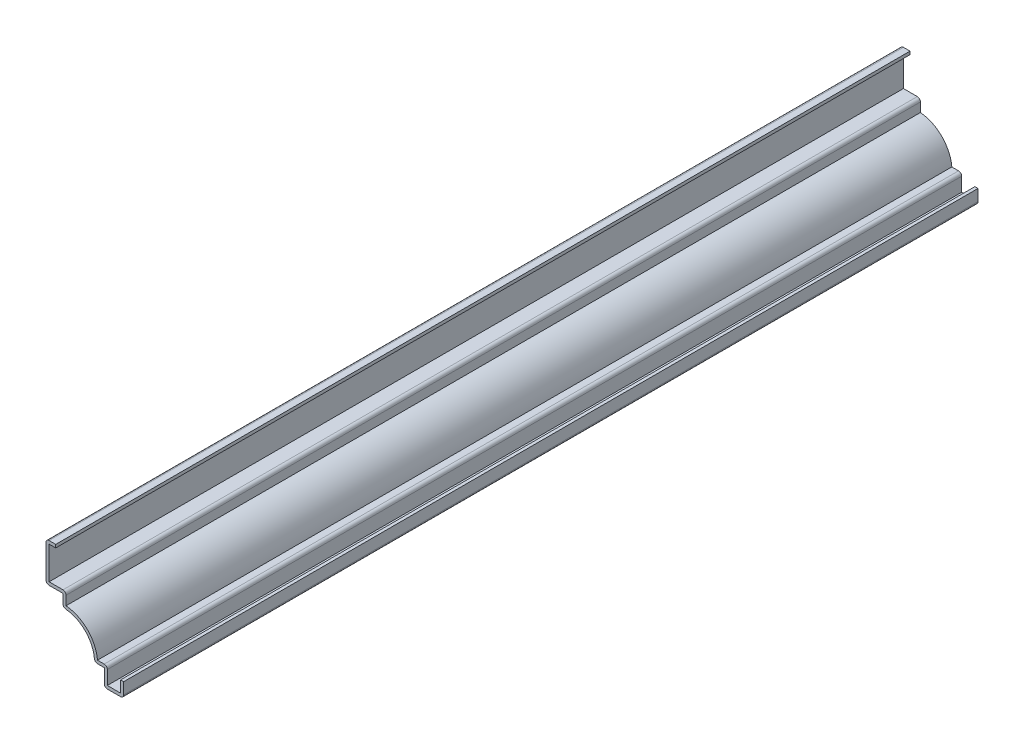
ISO-10303-21;
HEADER;
FILE_DESCRIPTION(('STEP AP214'),'2;1');
FILE_NAME('part.step','',(''),(''),'','','');
FILE_SCHEMA(('AUTOMOTIVE_DESIGN { 1 0 10303 214 1 1 1 1 }'));
ENDSEC;
DATA;
#1=APPLICATION_CONTEXT('core data for automotive mechanical design processes');
#2=APPLICATION_PROTOCOL_DEFINITION('international standard','automotive_design',2000,#1);
#3=PRODUCT_CONTEXT('',#1,'mechanical');
#4=PRODUCT('Part','Part','',(#3));
#5=PRODUCT_RELATED_PRODUCT_CATEGORY('part','',(#4));
#6=PRODUCT_DEFINITION_FORMATION('','',#4);
#7=PRODUCT_DEFINITION_CONTEXT('part definition',#1,'design');
#8=PRODUCT_DEFINITION('design','',#6,#7);
#9=PRODUCT_DEFINITION_SHAPE('','',#8);
#10=(LENGTH_UNIT() NAMED_UNIT(*) SI_UNIT(.MILLI.,.METRE.));
#11=(NAMED_UNIT(*) PLANE_ANGLE_UNIT() SI_UNIT($,.RADIAN.));
#12=(NAMED_UNIT(*) SI_UNIT($,.STERADIAN.) SOLID_ANGLE_UNIT());
#13=UNCERTAINTY_MEASURE_WITH_UNIT(LENGTH_MEASURE(1.E-05),#10,'distance_accuracy_value','');
#14=(GEOMETRIC_REPRESENTATION_CONTEXT(3) GLOBAL_UNCERTAINTY_ASSIGNED_CONTEXT((#13)) GLOBAL_UNIT_ASSIGNED_CONTEXT((#10,
#11,#12)) REPRESENTATION_CONTEXT('',''));
#15=CARTESIAN_POINT('',(0.,0.,0.));
#16=DIRECTION('',(0.,0.,1.));
#17=DIRECTION('',(1.,0.,0.));
#18=AXIS2_PLACEMENT_3D('',#15,#16,#17);
#19=CARTESIAN_POINT('',(-25.4,31.52775,-279.4));
#20=DIRECTION('',(0.,-1.,0.));
#21=DIRECTION('',(0.,0.,-1.));
#22=AXIS2_PLACEMENT_3D('',#19,#20,#21);
#23=PLANE('',#22);
#24=DIRECTION('',(1.,0.,0.));
#25=VECTOR('',#24,1.);
#26=CARTESIAN_POINT('',(-25.4,31.52775,0.));
#27=LINE('',#26,#25);
#28=CARTESIAN_POINT('',(-24.384,31.52775,0.));
#29=VERTEX_POINT('',#28);
#30=CARTESIAN_POINT('',(-22.225,31.52775,0.));
#31=VERTEX_POINT('',#30);
#32=EDGE_CURVE('E295',#29,#31,#27,.T.);
#33=ORIENTED_EDGE('',*,*,#32,.F.);
#34=DIRECTION('',(0.,0.,1.));
#35=VECTOR('',#34,1.);
#36=CARTESIAN_POINT('',(-24.384,31.52775,-279.4));
#37=LINE('',#36,#35);
#38=CARTESIAN_POINT('',(-24.384,31.52775,-279.4));
#39=VERTEX_POINT('',#38);
#40=EDGE_CURVE('E245',#39,#29,#37,.T.);
#41=ORIENTED_EDGE('',*,*,#40,.F.);
#42=DIRECTION('',(1.,0.,0.));
#43=VECTOR('',#42,1.);
#44=CARTESIAN_POINT('',(-25.4,31.52775,-279.4));
#45=LINE('',#44,#43);
#46=CARTESIAN_POINT('',(-22.225,31.52775,-279.4));
#47=VERTEX_POINT('',#46);
#48=EDGE_CURVE('E227',#39,#47,#45,.T.);
#49=ORIENTED_EDGE('',*,*,#48,.T.);
#50=DIRECTION('',(0.,0.,1.));
#51=VECTOR('',#50,1.);
#52=CARTESIAN_POINT('',(-22.225,31.52775,-279.4));
#53=LINE('',#52,#51);
#54=EDGE_CURVE('E235',#47,#31,#53,.T.);
#55=ORIENTED_EDGE('',*,*,#54,.T.);
#56=EDGE_LOOP('',(#33,#41,#49,#55));
#57=FACE_BOUND('',#56,.T.);
#58=ADVANCED_FACE('F35',(#57),#23,.T.);
#59=CARTESIAN_POINT('',(-24.384,19.84375,-279.4));
#60=DIRECTION('',(1.,0.,0.));
#61=DIRECTION('',(0.,0.,-1.));
#62=AXIS2_PLACEMENT_3D('',#59,#60,#61);
#63=PLANE('',#62);
#64=DIRECTION('',(0.,1.,0.));
#65=VECTOR('',#64,1.);
#66=CARTESIAN_POINT('',(-24.384,19.84375,0.));
#67=LINE('',#66,#65);
#68=CARTESIAN_POINT('',(-24.384,20.85975,0.));
#69=VERTEX_POINT('',#68);
#70=EDGE_CURVE('E246',#69,#29,#67,.T.);
#71=ORIENTED_EDGE('',*,*,#70,.F.);
#72=DIRECTION('',(0.,0.,1.));
#73=VECTOR('',#72,1.);
#74=CARTESIAN_POINT('',(-24.384,20.85975,-279.4));
#75=LINE('',#74,#73);
#76=CARTESIAN_POINT('',(-24.384,20.85975,-279.4));
#77=VERTEX_POINT('',#76);
#78=EDGE_CURVE('E343',#77,#69,#75,.T.);
#79=ORIENTED_EDGE('',*,*,#78,.F.);
#80=DIRECTION('',(0.,1.,0.));
#81=VECTOR('',#80,1.);
#82=CARTESIAN_POINT('',(-24.384,19.84375,-279.4));
#83=LINE('',#82,#81);
#84=EDGE_CURVE('E243',#77,#39,#83,.T.);
#85=ORIENTED_EDGE('',*,*,#84,.T.);
#86=ORIENTED_EDGE('',*,*,#40,.T.);
#87=EDGE_LOOP('',(#71,#79,#85,#86));
#88=FACE_BOUND('',#87,.T.);
#89=ADVANCED_FACE('F455',(#88),#63,.T.);
#90=CARTESIAN_POINT('',(-19.84375,20.85975,-279.4));
#91=DIRECTION('',(0.,1.,0.));
#92=DIRECTION('',(-1.,0.,0.));
#93=AXIS2_PLACEMENT_3D('',#90,#91,#92);
#94=PLANE('',#93);
#95=DIRECTION('',(-1.,0.,0.));
#96=VECTOR('',#95,1.);
#97=CARTESIAN_POINT('',(-19.84375,20.85975,0.));
#98=LINE('',#97,#96);
#99=CARTESIAN_POINT('',(-19.84375,20.85975,0.));
#100=VERTEX_POINT('',#99);
#101=EDGE_CURVE('E249',#100,#69,#98,.T.);
#102=ORIENTED_EDGE('',*,*,#101,.F.);
#103=DIRECTION('',(0.,0.,1.));
#104=VECTOR('',#103,1.);
#105=CARTESIAN_POINT('',(-19.84375,20.85975,-279.4));
#106=LINE('',#105,#104);
#107=CARTESIAN_POINT('',(-19.84375,20.85975,-279.4));
#108=VERTEX_POINT('',#107);
#109=EDGE_CURVE('E425',#100,#108,#106,.F.);
#110=ORIENTED_EDGE('',*,*,#109,.T.);
#111=DIRECTION('',(-1.,0.,0.));
#112=VECTOR('',#111,1.);
#113=CARTESIAN_POINT('',(-19.84375,20.85975,-279.4));
#114=LINE('',#113,#112);
#115=EDGE_CURVE('E292',#108,#77,#114,.T.);
#116=ORIENTED_EDGE('',*,*,#115,.T.);
#117=ORIENTED_EDGE('',*,*,#78,.T.);
#118=EDGE_LOOP('',(#102,#110,#116,#117));
#119=FACE_BOUND('',#118,.T.);
#120=ADVANCED_FACE('F552',(#119),#94,.T.);
#121=CARTESIAN_POINT('',(-18.82775,15.875,-279.4));
#122=DIRECTION('',(1.,0.,0.));
#123=DIRECTION('',(0.,0.,-1.));
#124=AXIS2_PLACEMENT_3D('',#121,#122,#123);
#125=PLANE('',#124);
#126=DIRECTION('',(0.,1.,0.));
#127=VECTOR('',#126,1.);
#128=CARTESIAN_POINT('',(-18.82775,15.875,-279.4));
#129=LINE('',#128,#127);
#130=CARTESIAN_POINT('',(-18.82775,16.8453731529513,-279.4));
#131=VERTEX_POINT('',#130);
#132=CARTESIAN_POINT('',(-18.82775,19.84375,-279.4));
#133=VERTEX_POINT('',#132);
#134=EDGE_CURVE('E289',#131,#133,#129,.T.);
#135=ORIENTED_EDGE('',*,*,#134,.T.);
#136=DIRECTION('',(0.,0.,1.));
#137=VECTOR('',#136,1.);
#138=CARTESIAN_POINT('',(-18.82775,19.84375,-279.4));
#139=LINE('',#138,#137);
#140=CARTESIAN_POINT('',(-18.82775,19.84375,0.));
#141=VERTEX_POINT('',#140);
#142=EDGE_CURVE('E422',#133,#141,#139,.T.);
#143=ORIENTED_EDGE('',*,*,#142,.T.);
#144=DIRECTION('',(0.,1.,0.));
#145=VECTOR('',#144,1.);
#146=CARTESIAN_POINT('',(-18.82775,15.875,0.));
#147=LINE('',#146,#145);
#148=CARTESIAN_POINT('',(-18.82775,16.8453731529513,0.));
#149=VERTEX_POINT('',#148);
#150=EDGE_CURVE('E337',#149,#141,#147,.T.);
#151=ORIENTED_EDGE('',*,*,#150,.F.);
#152=DIRECTION('',(0.,0.,1.));
#153=VECTOR('',#152,1.);
#154=CARTESIAN_POINT('',(-18.82775,16.8453731529513,-279.4));
#155=LINE('',#154,#153);
#156=EDGE_CURVE('E346',#131,#149,#155,.T.);
#157=ORIENTED_EDGE('',*,*,#156,.F.);
#158=EDGE_LOOP('',(#135,#143,#151,#157));
#159=FACE_BOUND('',#158,.T.);
#160=ADVANCED_FACE('F466',(#159),#125,.T.);
#161=CARTESIAN_POINT('',(-19.84375,5.55625,-279.4));
#162=DIRECTION('',(0.,0.,1.));
#163=DIRECTION('',(1.,0.,0.));
#164=AXIS2_PLACEMENT_3D('',#161,#162,#163);
#165=CYLINDRICAL_SURFACE('',#164,11.33475);
#166=CARTESIAN_POINT('',(-19.84375,5.55625,0.));
#167=DIRECTION('',(0.,0.,1.));
#168=DIRECTION('',(1.,0.,0.));
#169=AXIS2_PLACEMENT_3D('',#166,#167,#168);
#170=CIRCLE('',#169,11.33475);
#171=CARTESIAN_POINT('',(-8.55462684704875,6.57225,0.));
#172=VERTEX_POINT('',#171);
#173=EDGE_CURVE('E334',#172,#149,#170,.T.);
#174=ORIENTED_EDGE('',*,*,#173,.F.);
#175=DIRECTION('',(0.,0.,1.));
#176=VECTOR('',#175,1.);
#177=CARTESIAN_POINT('',(-8.55462684704875,6.57225,-279.4));
#178=LINE('',#177,#176);
#179=CARTESIAN_POINT('',(-8.55462684704875,6.57225,-279.4));
#180=VERTEX_POINT('',#179);
#181=EDGE_CURVE('E348',#180,#172,#178,.T.);
#182=ORIENTED_EDGE('',*,*,#181,.F.);
#183=CARTESIAN_POINT('',(-19.84375,5.55625,-279.4));
#184=DIRECTION('',(0.,0.,1.));
#185=DIRECTION('',(1.,0.,0.));
#186=AXIS2_PLACEMENT_3D('',#183,#184,#185);
#187=CIRCLE('',#186,11.33475);
#188=EDGE_CURVE('E286',#180,#131,#187,.T.);
#189=ORIENTED_EDGE('',*,*,#188,.T.);
#190=ORIENTED_EDGE('',*,*,#156,.T.);
#191=EDGE_LOOP('',(#174,#182,#189,#190));
#192=FACE_BOUND('',#191,.T.);
#193=ADVANCED_FACE('F471',(#192),#165,.T.);
#194=CARTESIAN_POINT('',(-6.35,6.57225,-279.4));
#195=DIRECTION('',(0.,1.,0.));
#196=DIRECTION('',(0.,0.,1.));
#197=AXIS2_PLACEMENT_3D('',#194,#195,#196);
#198=PLANE('',#197);
#199=DIRECTION('',(1.,0.,0.));
#200=VECTOR('',#199,1.);
#201=CARTESIAN_POINT('',(-6.35,6.57225,0.));
#202=LINE('',#201,#200);
#203=CARTESIAN_POINT('',(-6.35,6.57225,0.));
#204=VERTEX_POINT('',#203);
#205=EDGE_CURVE('E332',#204,#172,#202,.F.);
#206=ORIENTED_EDGE('',*,*,#205,.F.);
#207=DIRECTION('',(0.,0.,1.));
#208=VECTOR('',#207,1.);
#209=CARTESIAN_POINT('',(-6.35,6.57225,-279.4));
#210=LINE('',#209,#208);
#211=CARTESIAN_POINT('',(-6.35,6.57225,-279.4));
#212=VERTEX_POINT('',#211);
#213=EDGE_CURVE('E410',#204,#212,#210,.F.);
#214=ORIENTED_EDGE('',*,*,#213,.T.);
#215=DIRECTION('',(1.,0.,0.));
#216=VECTOR('',#215,1.);
#217=CARTESIAN_POINT('',(-6.35,6.57225,-279.4));
#218=LINE('',#217,#216);
#219=EDGE_CURVE('E284',#212,#180,#218,.F.);
#220=ORIENTED_EDGE('',*,*,#219,.T.);
#221=ORIENTED_EDGE('',*,*,#181,.T.);
#222=EDGE_LOOP('',(#206,#214,#220,#221));
#223=FACE_BOUND('',#222,.T.);
#224=ADVANCED_FACE('F708',(#223),#198,.T.);
#225=CARTESIAN_POINT('',(-5.334,0.,-279.4));
#226=DIRECTION('',(1.,0.,0.));
#227=DIRECTION('',(0.,0.,-1.));
#228=AXIS2_PLACEMENT_3D('',#225,#226,#227);
#229=PLANE('',#228);
#230=DIRECTION('',(0.,1.,0.));
#231=VECTOR('',#230,1.);
#232=CARTESIAN_POINT('',(-5.334,0.,-279.4));
#233=LINE('',#232,#231);
#234=CARTESIAN_POINT('',(-5.334,1.016,-279.4));
#235=VERTEX_POINT('',#234);
#236=CARTESIAN_POINT('',(-5.334,5.55625,-279.4));
#237=VERTEX_POINT('',#236);
#238=EDGE_CURVE('E281',#235,#237,#233,.T.);
#239=ORIENTED_EDGE('',*,*,#238,.T.);
#240=DIRECTION('',(0.,0.,1.));
#241=VECTOR('',#240,1.);
#242=CARTESIAN_POINT('',(-5.334,5.55625,-279.4));
#243=LINE('',#242,#241);
#244=CARTESIAN_POINT('',(-5.334,5.55625,0.));
#245=VERTEX_POINT('',#244);
#246=EDGE_CURVE('E407',#237,#245,#243,.T.);
#247=ORIENTED_EDGE('',*,*,#246,.T.);
#248=DIRECTION('',(0.,1.,0.));
#249=VECTOR('',#248,1.);
#250=CARTESIAN_POINT('',(-5.334,0.,0.));
#251=LINE('',#250,#249);
#252=CARTESIAN_POINT('',(-5.334,1.016,0.));
#253=VERTEX_POINT('',#252);
#254=EDGE_CURVE('E329',#253,#245,#251,.T.);
#255=ORIENTED_EDGE('',*,*,#254,.F.);
#256=DIRECTION('',(0.,0.,1.));
#257=VECTOR('',#256,1.);
#258=CARTESIAN_POINT('',(-5.334,1.016,-279.4));
#259=LINE('',#258,#257);
#260=EDGE_CURVE('E351',#235,#253,#259,.T.);
#261=ORIENTED_EDGE('',*,*,#260,.F.);
#262=EDGE_LOOP('',(#239,#247,#255,#261));
#263=FACE_BOUND('',#262,.T.);
#264=ADVANCED_FACE('F483',(#263),#229,.T.);
#265=CARTESIAN_POINT('',(0.,1.016,-279.4));
#266=DIRECTION('',(0.,1.,0.));
#267=DIRECTION('',(-1.,0.,0.));
#268=AXIS2_PLACEMENT_3D('',#265,#266,#267);
#269=PLANE('',#268);
#270=DIRECTION('',(-1.,0.,0.));
#271=VECTOR('',#270,1.);
#272=CARTESIAN_POINT('',(0.,1.016,0.));
#273=LINE('',#272,#271);
#274=CARTESIAN_POINT('',(-1.016,1.016,0.));
#275=VERTEX_POINT('',#274);
#276=EDGE_CURVE('E326',#275,#253,#273,.T.);
#277=ORIENTED_EDGE('',*,*,#276,.F.);
#278=DIRECTION('',(0.,0.,1.));
#279=VECTOR('',#278,1.);
#280=CARTESIAN_POINT('',(-1.016,1.016,-279.4));
#281=LINE('',#280,#279);
#282=CARTESIAN_POINT('',(-1.016,1.016,-279.4));
#283=VERTEX_POINT('',#282);
#284=EDGE_CURVE('E353',#283,#275,#281,.T.);
#285=ORIENTED_EDGE('',*,*,#284,.F.);
#286=DIRECTION('',(-1.,0.,0.));
#287=VECTOR('',#286,1.);
#288=CARTESIAN_POINT('',(0.,1.016,-279.4));
#289=LINE('',#288,#287);
#290=EDGE_CURVE('E278',#283,#235,#289,.T.);
#291=ORIENTED_EDGE('',*,*,#290,.T.);
#292=ORIENTED_EDGE('',*,*,#260,.T.);
#293=EDGE_LOOP('',(#277,#285,#291,#292));
#294=FACE_BOUND('',#293,.T.);
#295=ADVANCED_FACE('F488',(#294),#269,.T.);
#296=CARTESIAN_POINT('',(-1.016,4.7625,-279.4));
#297=DIRECTION('',(-1.,0.,0.));
#298=DIRECTION('',(0.,-1.,0.));
#299=AXIS2_PLACEMENT_3D('',#296,#297,#298);
#300=PLANE('',#299);
#301=DIRECTION('',(0.,-1.,0.));
#302=VECTOR('',#301,1.);
#303=CARTESIAN_POINT('',(-1.016,4.7625,0.));
#304=LINE('',#303,#302);
#305=CARTESIAN_POINT('',(-1.016,4.7625,0.));
#306=VERTEX_POINT('',#305);
#307=EDGE_CURVE('E323',#306,#275,#304,.T.);
#308=ORIENTED_EDGE('',*,*,#307,.F.);
#309=DIRECTION('',(0.,0.,1.));
#310=VECTOR('',#309,1.);
#311=CARTESIAN_POINT('',(-1.016,4.7625,-279.4));
#312=LINE('',#311,#310);
#313=CARTESIAN_POINT('',(-1.016,4.7625,-279.4));
#314=VERTEX_POINT('',#313);
#315=EDGE_CURVE('E355',#314,#306,#312,.T.);
#316=ORIENTED_EDGE('',*,*,#315,.F.);
#317=DIRECTION('',(0.,-1.,0.));
#318=VECTOR('',#317,1.);
#319=CARTESIAN_POINT('',(-1.016,4.7625,-279.4));
#320=LINE('',#319,#318);
#321=EDGE_CURVE('E275',#314,#283,#320,.T.);
#322=ORIENTED_EDGE('',*,*,#321,.T.);
#323=ORIENTED_EDGE('',*,*,#284,.T.);
#324=EDGE_LOOP('',(#308,#316,#322,#323));
#325=FACE_BOUND('',#324,.T.);
#326=ADVANCED_FACE('F492',(#325),#300,.T.);
#327=CARTESIAN_POINT('',(-1.016,4.7625,-279.4));
#328=DIRECTION('',(0.,-1.,0.));
#329=DIRECTION('',(0.,0.,-1.));
#330=AXIS2_PLACEMENT_3D('',#327,#328,#329);
#331=PLANE('',#330);
#332=DIRECTION('',(1.,0.,0.));
#333=VECTOR('',#332,1.);
#334=CARTESIAN_POINT('',(-1.016,4.7625,0.));
#335=LINE('',#334,#333);
#336=CARTESIAN_POINT('',(0.,4.7625,0.));
#337=VERTEX_POINT('',#336);
#338=EDGE_CURVE('E321',#306,#337,#335,.T.);
#339=ORIENTED_EDGE('',*,*,#338,.T.);
#340=DIRECTION('',(0.,0.,1.));
#341=VECTOR('',#340,1.);
#342=CARTESIAN_POINT('',(0.,4.7625,-279.4));
#343=LINE('',#342,#341);
#344=CARTESIAN_POINT('',(0.,4.7625,-279.4));
#345=VERTEX_POINT('',#344);
#346=EDGE_CURVE('E357',#345,#337,#343,.T.);
#347=ORIENTED_EDGE('',*,*,#346,.F.);
#348=DIRECTION('',(1.,0.,0.));
#349=VECTOR('',#348,1.);
#350=CARTESIAN_POINT('',(-1.016,4.7625,-279.4));
#351=LINE('',#350,#349);
#352=EDGE_CURVE('E273',#314,#345,#351,.T.);
#353=ORIENTED_EDGE('',*,*,#352,.F.);
#354=ORIENTED_EDGE('',*,*,#315,.T.);
#355=EDGE_LOOP('',(#339,#347,#353,#354));
#356=FACE_BOUND('',#355,.T.);
#357=ADVANCED_FACE('F496',(#356),#331,.F.);
#358=CARTESIAN_POINT('',(0.,4.7625,-279.4));
#359=DIRECTION('',(-1.,0.,0.));
#360=DIRECTION('',(0.,-1.,0.));
#361=AXIS2_PLACEMENT_3D('',#358,#359,#360);
#362=PLANE('',#361);
#363=DIRECTION('',(0.,-1.,0.));
#364=VECTOR('',#363,1.);
#365=CARTESIAN_POINT('',(0.,4.7625,0.));
#366=LINE('',#365,#364);
#367=CARTESIAN_POINT('',(0.,1.016,0.));
#368=VERTEX_POINT('',#367);
#369=EDGE_CURVE('E318',#337,#368,#366,.T.);
#370=ORIENTED_EDGE('',*,*,#369,.T.);
#371=DIRECTION('',(0.,0.,1.));
#372=VECTOR('',#371,1.);
#373=CARTESIAN_POINT('',(0.,1.016,-279.4));
#374=LINE('',#373,#372);
#375=CARTESIAN_POINT('',(0.,1.016,-279.4));
#376=VERTEX_POINT('',#375);
#377=EDGE_CURVE('E387',#368,#376,#374,.F.);
#378=ORIENTED_EDGE('',*,*,#377,.T.);
#379=DIRECTION('',(0.,-1.,0.));
#380=VECTOR('',#379,1.);
#381=CARTESIAN_POINT('',(0.,4.7625,-279.4));
#382=LINE('',#381,#380);
#383=EDGE_CURVE('E271',#345,#376,#382,.T.);
#384=ORIENTED_EDGE('',*,*,#383,.F.);
#385=ORIENTED_EDGE('',*,*,#346,.T.);
#386=EDGE_LOOP('',(#370,#378,#384,#385));
#387=FACE_BOUND('',#386,.T.);
#388=ADVANCED_FACE('F689',(#387),#362,.F.);
#389=CARTESIAN_POINT('',(0.,0.,-279.4));
#390=DIRECTION('',(0.,1.,0.));
#391=DIRECTION('',(-1.,0.,0.));
#392=AXIS2_PLACEMENT_3D('',#389,#390,#391);
#393=PLANE('',#392);
#394=DIRECTION('',(-1.,0.,0.));
#395=VECTOR('',#394,1.);
#396=CARTESIAN_POINT('',(0.,0.,-279.4));
#397=LINE('',#396,#395);
#398=CARTESIAN_POINT('',(-1.016,0.,-279.4));
#399=VERTEX_POINT('',#398);
#400=CARTESIAN_POINT('',(-5.334,0.,-279.4));
#401=VERTEX_POINT('',#400);
#402=EDGE_CURVE('E268',#399,#401,#397,.T.);
#403=ORIENTED_EDGE('',*,*,#402,.F.);
#404=DIRECTION('',(0.,0.,1.));
#405=VECTOR('',#404,1.);
#406=CARTESIAN_POINT('',(-1.016,0.,-279.4));
#407=LINE('',#406,#405);
#408=CARTESIAN_POINT('',(-1.016,0.,0.));
#409=VERTEX_POINT('',#408);
#410=EDGE_CURVE('E368',#399,#409,#407,.T.);
#411=ORIENTED_EDGE('',*,*,#410,.T.);
#412=DIRECTION('',(-1.,0.,0.));
#413=VECTOR('',#412,1.);
#414=CARTESIAN_POINT('',(0.,0.,0.));
#415=LINE('',#414,#413);
#416=CARTESIAN_POINT('',(-5.334,0.,0.));
#417=VERTEX_POINT('',#416);
#418=EDGE_CURVE('E315',#409,#417,#415,.T.);
#419=ORIENTED_EDGE('',*,*,#418,.T.);
#420=DIRECTION('',(0.,0.,1.));
#421=VECTOR('',#420,1.);
#422=CARTESIAN_POINT('',(-5.334,0.,-279.4));
#423=LINE('',#422,#421);
#424=EDGE_CURVE('E342',#417,#401,#423,.F.);
#425=ORIENTED_EDGE('',*,*,#424,.T.);
#426=EDGE_LOOP('',(#403,#411,#419,#425));
#427=FACE_BOUND('',#426,.T.);
#428=ADVANCED_FACE('F506',(#427),#393,.F.);
#429=CARTESIAN_POINT('',(-6.35,0.,-279.4));
#430=DIRECTION('',(1.,0.,0.));
#431=DIRECTION('',(0.,0.,-1.));
#432=AXIS2_PLACEMENT_3D('',#429,#430,#431);
#433=PLANE('',#432);
#434=DIRECTION('',(0.,1.,0.));
#435=VECTOR('',#434,1.);
#436=CARTESIAN_POINT('',(-6.35,0.,-279.4));
#437=LINE('',#436,#435);
#438=CARTESIAN_POINT('',(-6.35,1.016,-279.4));
#439=VERTEX_POINT('',#438);
#440=CARTESIAN_POINT('',(-6.35,5.55625,-279.4));
#441=VERTEX_POINT('',#440);
#442=EDGE_CURVE('E266',#439,#441,#437,.T.);
#443=ORIENTED_EDGE('',*,*,#442,.F.);
#444=DIRECTION('',(0.,0.,1.));
#445=VECTOR('',#444,1.);
#446=CARTESIAN_POINT('',(-6.35,1.016,-279.4));
#447=LINE('',#446,#445);
#448=CARTESIAN_POINT('',(-6.35,1.016,0.));
#449=VERTEX_POINT('',#448);
#450=EDGE_CURVE('E404',#439,#449,#447,.T.);
#451=ORIENTED_EDGE('',*,*,#450,.T.);
#452=DIRECTION('',(0.,1.,0.));
#453=VECTOR('',#452,1.);
#454=CARTESIAN_POINT('',(-6.35,0.,0.));
#455=LINE('',#454,#453);
#456=CARTESIAN_POINT('',(-6.35,5.55625,0.));
#457=VERTEX_POINT('',#456);
#458=EDGE_CURVE('E313',#449,#457,#455,.T.);
#459=ORIENTED_EDGE('',*,*,#458,.T.);
#460=DIRECTION('',(0.,0.,1.));
#461=VECTOR('',#460,1.);
#462=CARTESIAN_POINT('',(-6.35,5.55625,-279.4));
#463=LINE('',#462,#461);
#464=EDGE_CURVE('E360',#441,#457,#463,.T.);
#465=ORIENTED_EDGE('',*,*,#464,.F.);
#466=EDGE_LOOP('',(#443,#451,#459,#465));
#467=FACE_BOUND('',#466,.T.);
#468=ADVANCED_FACE('F517',(#467),#433,.F.);
#469=CARTESIAN_POINT('',(-6.35,5.55625,-279.4));
#470=DIRECTION('',(0.,1.,0.));
#471=DIRECTION('',(0.,0.,1.));
#472=AXIS2_PLACEMENT_3D('',#469,#470,#471);
#473=PLANE('',#472);
#474=DIRECTION('',(-1.,0.,0.));
#475=VECTOR('',#474,1.);
#476=CARTESIAN_POINT('',(-6.35,5.55625,0.));
#477=LINE('',#476,#475);
#478=CARTESIAN_POINT('',(-8.55462684704875,5.55625,0.));
#479=VERTEX_POINT('',#478);
#480=EDGE_CURVE('E310',#457,#479,#477,.T.);
#481=ORIENTED_EDGE('',*,*,#480,.T.);
#482=DIRECTION('',(0.,0.,1.));
#483=VECTOR('',#482,1.);
#484=CARTESIAN_POINT('',(-8.55462684704875,5.55625,-279.4));
#485=LINE('',#484,#483);
#486=CARTESIAN_POINT('',(-8.55462684704875,5.55625,-279.4));
#487=VERTEX_POINT('',#486);
#488=EDGE_CURVE('E417',#479,#487,#485,.F.);
#489=ORIENTED_EDGE('',*,*,#488,.T.);
#490=DIRECTION('',(-1.,0.,0.));
#491=VECTOR('',#490,1.);
#492=CARTESIAN_POINT('',(-6.35,5.55625,-279.4));
#493=LINE('',#492,#491);
#494=EDGE_CURVE('E263',#441,#487,#493,.T.);
#495=ORIENTED_EDGE('',*,*,#494,.F.);
#496=ORIENTED_EDGE('',*,*,#464,.T.);
#497=EDGE_LOOP('',(#481,#489,#495,#496));
#498=FACE_BOUND('',#497,.T.);
#499=ADVANCED_FACE('F545',(#498),#473,.F.);
#500=CARTESIAN_POINT('',(-19.84375,5.55625,-279.4));
#501=DIRECTION('',(0.,0.,1.));
#502=DIRECTION('',(1.,0.,0.));
#503=AXIS2_PLACEMENT_3D('',#500,#501,#502);
#504=CYLINDRICAL_SURFACE('',#503,10.31875);
#505=CARTESIAN_POINT('',(-19.84375,5.55625,-279.4));
#506=DIRECTION('',(0.,0.,1.));
#507=DIRECTION('',(1.,0.,0.));
#508=AXIS2_PLACEMENT_3D('',#505,#506,#507);
#509=CIRCLE('',#508,10.31875);
#510=CARTESIAN_POINT('',(-9.56653704563262,6.48117997198879,-279.4));
#511=VERTEX_POINT('',#510);
#512=CARTESIAN_POINT('',(-18.9188200280112,15.8334629543674,-279.4));
#513=VERTEX_POINT('',#512);
#514=EDGE_CURVE('E260',#511,#513,#509,.T.);
#515=ORIENTED_EDGE('',*,*,#514,.F.);
#516=DIRECTION('',(0.,0.,1.));
#517=VECTOR('',#516,1.);
#518=CARTESIAN_POINT('',(-9.56653704563261,6.48117997198879,-279.4));
#519=LINE('',#518,#517);
#520=CARTESIAN_POINT('',(-9.56653704563262,6.48117997198879,0.));
#521=VERTEX_POINT('',#520);
#522=EDGE_CURVE('E414',#511,#521,#519,.T.);
#523=ORIENTED_EDGE('',*,*,#522,.T.);
#524=CARTESIAN_POINT('',(-19.84375,5.55625,0.));
#525=DIRECTION('',(0.,0.,1.));
#526=DIRECTION('',(1.,0.,0.));
#527=AXIS2_PLACEMENT_3D('',#524,#525,#526);
#528=CIRCLE('',#527,10.31875);
#529=CARTESIAN_POINT('',(-18.9188200280112,15.8334629543674,0.));
#530=VERTEX_POINT('',#529);
#531=EDGE_CURVE('E307',#521,#530,#528,.T.);
#532=ORIENTED_EDGE('',*,*,#531,.T.);
#533=DIRECTION('',(0.,0.,1.));
#534=VECTOR('',#533,1.);
#535=CARTESIAN_POINT('',(-18.9188200280112,15.8334629543674,-279.4));
#536=LINE('',#535,#534);
#537=EDGE_CURVE('E412',#530,#513,#536,.F.);
#538=ORIENTED_EDGE('',*,*,#537,.T.);
#539=EDGE_LOOP('',(#515,#523,#532,#538));
#540=FACE_BOUND('',#539,.T.);
#541=ADVANCED_FACE('F529',(#540),#504,.F.);
#542=CARTESIAN_POINT('',(-19.84375,15.875,-279.4));
#543=DIRECTION('',(1.,0.,0.));
#544=DIRECTION('',(0.,0.,-1.));
#545=AXIS2_PLACEMENT_3D('',#542,#543,#544);
#546=PLANE('',#545);
#547=DIRECTION('',(0.,1.,0.));
#548=VECTOR('',#547,1.);
#549=CARTESIAN_POINT('',(-19.84375,15.875,-279.4));
#550=LINE('',#549,#548);
#551=CARTESIAN_POINT('',(-19.84375,16.8453731529513,-279.4));
#552=VERTEX_POINT('',#551);
#553=CARTESIAN_POINT('',(-19.84375,19.84375,-279.4));
#554=VERTEX_POINT('',#553);
#555=EDGE_CURVE('E258',#552,#554,#550,.T.);
#556=ORIENTED_EDGE('',*,*,#555,.F.);
#557=DIRECTION('',(0.,0.,1.));
#558=VECTOR('',#557,1.);
#559=CARTESIAN_POINT('',(-19.84375,16.8453731529513,-279.4));
#560=LINE('',#559,#558);
#561=CARTESIAN_POINT('',(-19.84375,16.8453731529513,0.));
#562=VERTEX_POINT('',#561);
#563=EDGE_CURVE('E419',#552,#562,#560,.T.);
#564=ORIENTED_EDGE('',*,*,#563,.T.);
#565=DIRECTION('',(0.,1.,0.));
#566=VECTOR('',#565,1.);
#567=CARTESIAN_POINT('',(-19.84375,15.875,0.));
#568=LINE('',#567,#566);
#569=CARTESIAN_POINT('',(-19.84375,19.84375,0.));
#570=VERTEX_POINT('',#569);
#571=EDGE_CURVE('E305',#562,#570,#568,.T.);
#572=ORIENTED_EDGE('',*,*,#571,.T.);
#573=DIRECTION('',(0.,0.,1.));
#574=VECTOR('',#573,1.);
#575=CARTESIAN_POINT('',(-19.84375,19.84375,-279.4));
#576=LINE('',#575,#574);
#577=EDGE_CURVE('E363',#554,#570,#576,.T.);
#578=ORIENTED_EDGE('',*,*,#577,.F.);
#579=EDGE_LOOP('',(#556,#564,#572,#578));
#580=FACE_BOUND('',#579,.T.);
#581=ADVANCED_FACE('F537',(#580),#546,.F.);
#582=CARTESIAN_POINT('',(-19.84375,19.84375,-279.4));
#583=DIRECTION('',(0.,1.,0.));
#584=DIRECTION('',(-1.,0.,0.));
#585=AXIS2_PLACEMENT_3D('',#582,#583,#584);
#586=PLANE('',#585);
#587=DIRECTION('',(-1.,0.,0.));
#588=VECTOR('',#587,1.);
#589=CARTESIAN_POINT('',(-19.84375,19.84375,0.));
#590=LINE('',#589,#588);
#591=CARTESIAN_POINT('',(-24.384,19.84375,0.));
#592=VERTEX_POINT('',#591);
#593=EDGE_CURVE('E302',#570,#592,#590,.T.);
#594=ORIENTED_EDGE('',*,*,#593,.T.);
#595=DIRECTION('',(0.,0.,1.));
#596=VECTOR('',#595,1.);
#597=CARTESIAN_POINT('',(-24.384,19.84375,-279.4));
#598=LINE('',#597,#596);
#599=CARTESIAN_POINT('',(-24.384,19.84375,-279.4));
#600=VERTEX_POINT('',#599);
#601=EDGE_CURVE('E43',#592,#600,#598,.F.);
#602=ORIENTED_EDGE('',*,*,#601,.T.);
#603=DIRECTION('',(-1.,0.,0.));
#604=VECTOR('',#603,1.);
#605=CARTESIAN_POINT('',(-19.84375,19.84375,-279.4));
#606=LINE('',#605,#604);
#607=EDGE_CURVE('E255',#554,#600,#606,.T.);
#608=ORIENTED_EDGE('',*,*,#607,.F.);
#609=ORIENTED_EDGE('',*,*,#577,.T.);
#610=EDGE_LOOP('',(#594,#602,#608,#609));
#611=FACE_BOUND('',#610,.T.);
#612=ADVANCED_FACE('F433',(#611),#586,.F.);
#613=CARTESIAN_POINT('',(-25.4,19.84375,-279.4));
#614=DIRECTION('',(1.,0.,0.));
#615=DIRECTION('',(0.,0.,-1.));
#616=AXIS2_PLACEMENT_3D('',#613,#614,#615);
#617=PLANE('',#616);
#618=DIRECTION('',(0.,1.,0.));
#619=VECTOR('',#618,1.);
#620=CARTESIAN_POINT('',(-25.4,19.84375,-279.4));
#621=LINE('',#620,#619);
#622=CARTESIAN_POINT('',(-25.4,20.85975,-279.4));
#623=VERTEX_POINT('',#622);
#624=CARTESIAN_POINT('',(-25.4,31.52775,-279.4));
#625=VERTEX_POINT('',#624);
#626=EDGE_CURVE('E253',#623,#625,#621,.T.);
#627=ORIENTED_EDGE('',*,*,#626,.F.);
#628=DIRECTION('',(0.,0.,1.));
#629=VECTOR('',#628,1.);
#630=CARTESIAN_POINT('',(-25.4,20.85975,-279.4));
#631=LINE('',#630,#629);
#632=CARTESIAN_POINT('',(-25.4,20.85975,0.));
#633=VERTEX_POINT('',#632);
#634=EDGE_CURVE('E428',#623,#633,#631,.T.);
#635=ORIENTED_EDGE('',*,*,#634,.T.);
#636=DIRECTION('',(0.,1.,0.));
#637=VECTOR('',#636,1.);
#638=CARTESIAN_POINT('',(-25.4,19.84375,0.));
#639=LINE('',#638,#637);
#640=CARTESIAN_POINT('',(-25.4,31.52775,0.));
#641=VERTEX_POINT('',#640);
#642=EDGE_CURVE('E300',#633,#641,#639,.T.);
#643=ORIENTED_EDGE('',*,*,#642,.T.);
#644=DIRECTION('',(0.,0.,1.));
#645=VECTOR('',#644,1.);
#646=CARTESIAN_POINT('',(-25.4,31.52775,-279.4));
#647=LINE('',#646,#645);
#648=EDGE_CURVE('E58',#641,#625,#647,.F.);
#649=ORIENTED_EDGE('',*,*,#648,.T.);
#650=EDGE_LOOP('',(#627,#635,#643,#649));
#651=FACE_BOUND('',#650,.T.);
#652=ADVANCED_FACE('F442',(#651),#617,.F.);
#653=CARTESIAN_POINT('',(-25.4,32.54375,-279.4));
#654=DIRECTION('',(0.,-1.,0.));
#655=DIRECTION('',(0.,0.,-1.));
#656=AXIS2_PLACEMENT_3D('',#653,#654,#655);
#657=PLANE('',#656);
#658=DIRECTION('',(1.,0.,0.));
#659=VECTOR('',#658,1.);
#660=CARTESIAN_POINT('',(-25.4,32.54375,-279.4));
#661=LINE('',#660,#659);
#662=CARTESIAN_POINT('',(-24.384,32.54375,-279.4));
#663=VERTEX_POINT('',#662);
#664=CARTESIAN_POINT('',(-22.225,32.54375,-279.4));
#665=VERTEX_POINT('',#664);
#666=EDGE_CURVE('E229',#663,#665,#661,.T.);
#667=ORIENTED_EDGE('',*,*,#666,.F.);
#668=DIRECTION('',(0.,0.,1.));
#669=VECTOR('',#668,1.);
#670=CARTESIAN_POINT('',(-24.384,32.54375,-279.4));
#671=LINE('',#670,#669);
#672=CARTESIAN_POINT('',(-24.384,32.54375,0.));
#673=VERTEX_POINT('',#672);
#674=EDGE_CURVE('E11',#663,#673,#671,.T.);
#675=ORIENTED_EDGE('',*,*,#674,.T.);
#676=DIRECTION('',(1.,0.,0.));
#677=VECTOR('',#676,1.);
#678=CARTESIAN_POINT('',(-25.4,32.54375,0.));
#679=LINE('',#678,#677);
#680=CARTESIAN_POINT('',(-22.225,32.54375,0.));
#681=VERTEX_POINT('',#680);
#682=EDGE_CURVE('E298',#673,#681,#679,.T.);
#683=ORIENTED_EDGE('',*,*,#682,.T.);
#684=DIRECTION('',(0.,0.,1.));
#685=VECTOR('',#684,1.);
#686=CARTESIAN_POINT('',(-22.225,32.54375,-279.4));
#687=LINE('',#686,#685);
#688=EDGE_CURVE('E242',#665,#681,#687,.T.);
#689=ORIENTED_EDGE('',*,*,#688,.F.);
#690=EDGE_LOOP('',(#667,#675,#683,#689));
#691=FACE_BOUND('',#690,.T.);
#692=ADVANCED_FACE('F450',(#691),#657,.F.);
#693=CARTESIAN_POINT('',(-22.225,32.54375,-279.4));
#694=DIRECTION('',(-1.,0.,0.));
#695=DIRECTION('',(0.,0.,1.));
#696=AXIS2_PLACEMENT_3D('',#693,#694,#695);
#697=PLANE('',#696);
#698=DIRECTION('',(0.,-1.,0.));
#699=VECTOR('',#698,1.);
#700=CARTESIAN_POINT('',(-22.225,32.54375,0.));
#701=LINE('',#700,#699);
#702=EDGE_CURVE('E238',#681,#31,#701,.T.);
#703=ORIENTED_EDGE('',*,*,#702,.T.);
#704=ORIENTED_EDGE('',*,*,#54,.F.);
#705=DIRECTION('',(0.,-1.,0.));
#706=VECTOR('',#705,1.);
#707=CARTESIAN_POINT('',(-22.225,32.54375,-279.4));
#708=LINE('',#707,#706);
#709=EDGE_CURVE('E221',#665,#47,#708,.T.);
#710=ORIENTED_EDGE('',*,*,#709,.F.);
#711=ORIENTED_EDGE('',*,*,#688,.T.);
#712=EDGE_LOOP('',(#703,#704,#710,#711));
#713=FACE_BOUND('',#712,.T.);
#714=ADVANCED_FACE('F236',(#713),#697,.F.);
#715=CARTESIAN_POINT('',(-19.84375,5.55625,-279.4));
#716=DIRECTION('',(0.,0.,1.));
#717=DIRECTION('',(1.,0.,0.));
#718=AXIS2_PLACEMENT_3D('',#715,#716,#717);
#719=PLANE('',#718);
#720=ORIENTED_EDGE('',*,*,#383,.T.);
#721=CARTESIAN_POINT('',(-1.016,1.016,-279.4));
#722=DIRECTION('',(0.,0.,1.));
#723=DIRECTION('',(1.,0.,0.));
#724=AXIS2_PLACEMENT_3D('',#721,#722,#723);
#725=CIRCLE('',#724,1.016);
#726=EDGE_CURVE('E402',#376,#399,#725,.F.);
#727=ORIENTED_EDGE('',*,*,#726,.T.);
#728=ORIENTED_EDGE('',*,*,#402,.T.);
#729=CARTESIAN_POINT('',(-5.334,1.016,-279.4));
#730=DIRECTION('',(0.,0.,1.));
#731=DIRECTION('',(1.,0.,0.));
#732=AXIS2_PLACEMENT_3D('',#729,#730,#731);
#733=CIRCLE('',#732,1.016);
#734=EDGE_CURVE('E400',#401,#439,#733,.F.);
#735=ORIENTED_EDGE('',*,*,#734,.T.);
#736=ORIENTED_EDGE('',*,*,#442,.T.);
#737=ORIENTED_EDGE('',*,*,#494,.T.);
#738=CARTESIAN_POINT('',(-8.55462684704875,6.57225,-279.4));
#739=DIRECTION('',(0.,0.,1.));
#740=DIRECTION('',(1.,0.,0.));
#741=AXIS2_PLACEMENT_3D('',#738,#739,#740);
#742=CIRCLE('',#741,1.016);
#743=EDGE_CURVE('E396',#487,#511,#742,.F.);
#744=ORIENTED_EDGE('',*,*,#743,.T.);
#745=ORIENTED_EDGE('',*,*,#514,.T.);
#746=CARTESIAN_POINT('',(-18.82775,16.8453731529513,-279.4));
#747=DIRECTION('',(0.,0.,1.));
#748=DIRECTION('',(1.,0.,0.));
#749=AXIS2_PLACEMENT_3D('',#746,#747,#748);
#750=CIRCLE('',#749,1.016);
#751=EDGE_CURVE('E394',#513,#552,#750,.F.);
#752=ORIENTED_EDGE('',*,*,#751,.T.);
#753=ORIENTED_EDGE('',*,*,#555,.T.);
#754=ORIENTED_EDGE('',*,*,#607,.T.);
#755=CARTESIAN_POINT('',(-24.384,20.85975,-279.4));
#756=DIRECTION('',(0.,0.,1.));
#757=DIRECTION('',(1.,0.,0.));
#758=AXIS2_PLACEMENT_3D('',#755,#756,#757);
#759=CIRCLE('',#758,1.016);
#760=EDGE_CURVE('E390',#600,#623,#759,.F.);
#761=ORIENTED_EDGE('',*,*,#760,.T.);
#762=ORIENTED_EDGE('',*,*,#626,.T.);
#763=CARTESIAN_POINT('',(-24.384,31.52775,-279.4));
#764=DIRECTION('',(0.,0.,1.));
#765=DIRECTION('',(1.,0.,0.));
#766=AXIS2_PLACEMENT_3D('',#763,#764,#765);
#767=CIRCLE('',#766,1.016);
#768=EDGE_CURVE('E50',#625,#663,#767,.F.);
#769=ORIENTED_EDGE('',*,*,#768,.T.);
#770=ORIENTED_EDGE('',*,*,#666,.T.);
#771=ORIENTED_EDGE('',*,*,#709,.T.);
#772=ORIENTED_EDGE('',*,*,#48,.F.);
#773=ORIENTED_EDGE('',*,*,#84,.F.);
#774=ORIENTED_EDGE('',*,*,#115,.F.);
#775=CARTESIAN_POINT('',(-19.84375,19.84375,-279.4));
#776=DIRECTION('',(0.,0.,1.));
#777=DIRECTION('',(1.,0.,0.));
#778=AXIS2_PLACEMENT_3D('',#775,#776,#777);
#779=CIRCLE('',#778,1.016);
#780=EDGE_CURVE('E392',#108,#133,#779,.F.);
#781=ORIENTED_EDGE('',*,*,#780,.T.);
#782=ORIENTED_EDGE('',*,*,#134,.F.);
#783=ORIENTED_EDGE('',*,*,#188,.F.);
#784=ORIENTED_EDGE('',*,*,#219,.F.);
#785=CARTESIAN_POINT('',(-6.35,5.55625,-279.4));
#786=DIRECTION('',(0.,0.,1.));
#787=DIRECTION('',(1.,0.,0.));
#788=AXIS2_PLACEMENT_3D('',#785,#786,#787);
#789=CIRCLE('',#788,1.016);
#790=EDGE_CURVE('E398',#212,#237,#789,.F.);
#791=ORIENTED_EDGE('',*,*,#790,.T.);
#792=ORIENTED_EDGE('',*,*,#238,.F.);
#793=ORIENTED_EDGE('',*,*,#290,.F.);
#794=ORIENTED_EDGE('',*,*,#321,.F.);
#795=ORIENTED_EDGE('',*,*,#352,.T.);
#796=EDGE_LOOP('',(#720,#727,#728,#735,#736,#737,#744,#745,#752,#753,#754,#761,#762,#769,#770,
#771,#772,#773,#774,#781,#782,#783,#784,#791,#792,#793,#794,#795));
#797=FACE_BOUND('',#796,.T.);
#798=ADVANCED_FACE('F224',(#797),#719,.F.);
#799=CARTESIAN_POINT('',(-19.84375,5.55625,0.));
#800=DIRECTION('',(0.,0.,1.));
#801=DIRECTION('',(1.,0.,0.));
#802=AXIS2_PLACEMENT_3D('',#799,#800,#801);
#803=PLANE('',#802);
#804=ORIENTED_EDGE('',*,*,#418,.F.);
#805=CARTESIAN_POINT('',(-1.016,1.016,0.));
#806=DIRECTION('',(0.,0.,1.));
#807=DIRECTION('',(1.,0.,0.));
#808=AXIS2_PLACEMENT_3D('',#805,#806,#807);
#809=CIRCLE('',#808,1.016);
#810=EDGE_CURVE('E385',#409,#368,#809,.T.);
#811=ORIENTED_EDGE('',*,*,#810,.T.);
#812=ORIENTED_EDGE('',*,*,#369,.F.);
#813=ORIENTED_EDGE('',*,*,#338,.F.);
#814=ORIENTED_EDGE('',*,*,#307,.T.);
#815=ORIENTED_EDGE('',*,*,#276,.T.);
#816=ORIENTED_EDGE('',*,*,#254,.T.);
#817=CARTESIAN_POINT('',(-6.35,5.55625,0.));
#818=DIRECTION('',(0.,0.,1.));
#819=DIRECTION('',(1.,0.,0.));
#820=AXIS2_PLACEMENT_3D('',#817,#818,#819);
#821=CIRCLE('',#820,1.016);
#822=EDGE_CURVE('E381',#245,#204,#821,.T.);
#823=ORIENTED_EDGE('',*,*,#822,.T.);
#824=ORIENTED_EDGE('',*,*,#205,.T.);
#825=ORIENTED_EDGE('',*,*,#173,.T.);
#826=ORIENTED_EDGE('',*,*,#150,.T.);
#827=CARTESIAN_POINT('',(-19.84375,19.84375,0.));
#828=DIRECTION('',(0.,0.,1.));
#829=DIRECTION('',(1.,0.,0.));
#830=AXIS2_PLACEMENT_3D('',#827,#828,#829);
#831=CIRCLE('',#830,1.016);
#832=EDGE_CURVE('E375',#141,#100,#831,.T.);
#833=ORIENTED_EDGE('',*,*,#832,.T.);
#834=ORIENTED_EDGE('',*,*,#101,.T.);
#835=ORIENTED_EDGE('',*,*,#70,.T.);
#836=ORIENTED_EDGE('',*,*,#32,.T.);
#837=ORIENTED_EDGE('',*,*,#702,.F.);
#838=ORIENTED_EDGE('',*,*,#682,.F.);
#839=CARTESIAN_POINT('',(-24.384,31.52775,0.));
#840=DIRECTION('',(0.,0.,1.));
#841=DIRECTION('',(1.,0.,0.));
#842=AXIS2_PLACEMENT_3D('',#839,#840,#841);
#843=CIRCLE('',#842,1.016);
#844=EDGE_CURVE('E371',#673,#641,#843,.T.);
#845=ORIENTED_EDGE('',*,*,#844,.T.);
#846=ORIENTED_EDGE('',*,*,#642,.F.);
#847=CARTESIAN_POINT('',(-24.384,20.85975,0.));
#848=DIRECTION('',(0.,0.,1.));
#849=DIRECTION('',(1.,0.,0.));
#850=AXIS2_PLACEMENT_3D('',#847,#848,#849);
#851=CIRCLE('',#850,1.016);
#852=EDGE_CURVE('E373',#633,#592,#851,.T.);
#853=ORIENTED_EDGE('',*,*,#852,.T.);
#854=ORIENTED_EDGE('',*,*,#593,.F.);
#855=ORIENTED_EDGE('',*,*,#571,.F.);
#856=CARTESIAN_POINT('',(-18.82775,16.8453731529513,0.));
#857=DIRECTION('',(0.,0.,1.));
#858=DIRECTION('',(1.,0.,0.));
#859=AXIS2_PLACEMENT_3D('',#856,#857,#858);
#860=CIRCLE('',#859,1.016);
#861=EDGE_CURVE('E377',#562,#530,#860,.T.);
#862=ORIENTED_EDGE('',*,*,#861,.T.);
#863=ORIENTED_EDGE('',*,*,#531,.F.);
#864=CARTESIAN_POINT('',(-8.55462684704875,6.57225,0.));
#865=DIRECTION('',(0.,0.,1.));
#866=DIRECTION('',(1.,0.,0.));
#867=AXIS2_PLACEMENT_3D('',#864,#865,#866);
#868=CIRCLE('',#867,1.016);
#869=EDGE_CURVE('E379',#521,#479,#868,.T.);
#870=ORIENTED_EDGE('',*,*,#869,.T.);
#871=ORIENTED_EDGE('',*,*,#480,.F.);
#872=ORIENTED_EDGE('',*,*,#458,.F.);
#873=CARTESIAN_POINT('',(-5.334,1.016,0.));
#874=DIRECTION('',(0.,0.,1.));
#875=DIRECTION('',(1.,0.,0.));
#876=AXIS2_PLACEMENT_3D('',#873,#874,#875);
#877=CIRCLE('',#876,1.016);
#878=EDGE_CURVE('E383',#449,#417,#877,.T.);
#879=ORIENTED_EDGE('',*,*,#878,.T.);
#880=EDGE_LOOP('',(#804,#811,#812,#813,#814,#815,#816,#823,#824,#825,#826,#833,#834,#835,#836,
#837,#838,#845,#846,#853,#854,#855,#862,#863,#870,#871,#872,#879));
#881=FACE_BOUND('',#880,.T.);
#882=ADVANCED_FACE('F445',(#881),#803,.T.);
#883=CARTESIAN_POINT('',(-1.016,1.016,-279.4));
#884=DIRECTION('',(0.,0.,1.));
#885=DIRECTION('',(1.,0.,0.));
#886=AXIS2_PLACEMENT_3D('',#883,#884,#885);
#887=CYLINDRICAL_SURFACE('',#886,1.016);
#888=ORIENTED_EDGE('',*,*,#726,.F.);
#889=ORIENTED_EDGE('',*,*,#377,.F.);
#890=ORIENTED_EDGE('',*,*,#810,.F.);
#891=ORIENTED_EDGE('',*,*,#410,.F.);
#892=EDGE_LOOP('',(#888,#889,#890,#891));
#893=FACE_BOUND('',#892,.T.);
#894=ADVANCED_FACE('F504',(#893),#887,.T.);
#895=CARTESIAN_POINT('',(-5.334,1.016,-279.4));
#896=DIRECTION('',(0.,0.,1.));
#897=DIRECTION('',(1.,0.,0.));
#898=AXIS2_PLACEMENT_3D('',#895,#896,#897);
#899=CYLINDRICAL_SURFACE('',#898,1.016);
#900=ORIENTED_EDGE('',*,*,#734,.F.);
#901=ORIENTED_EDGE('',*,*,#424,.F.);
#902=ORIENTED_EDGE('',*,*,#878,.F.);
#903=ORIENTED_EDGE('',*,*,#450,.F.);
#904=EDGE_LOOP('',(#900,#901,#902,#903));
#905=FACE_BOUND('',#904,.T.);
#906=ADVANCED_FACE('F514',(#905),#899,.T.);
#907=CARTESIAN_POINT('',(-6.35,5.55625,-279.4));
#908=DIRECTION('',(0.,0.,1.));
#909=DIRECTION('',(1.,0.,0.));
#910=AXIS2_PLACEMENT_3D('',#907,#908,#909);
#911=CYLINDRICAL_SURFACE('',#910,1.016);
#912=ORIENTED_EDGE('',*,*,#790,.F.);
#913=ORIENTED_EDGE('',*,*,#213,.F.);
#914=ORIENTED_EDGE('',*,*,#822,.F.);
#915=ORIENTED_EDGE('',*,*,#246,.F.);
#916=EDGE_LOOP('',(#912,#913,#914,#915));
#917=FACE_BOUND('',#916,.T.);
#918=ADVANCED_FACE('F480',(#917),#911,.T.);
#919=CARTESIAN_POINT('',(-8.55462684704875,6.57225,-279.4));
#920=DIRECTION('',(0.,0.,1.));
#921=DIRECTION('',(1.,0.,0.));
#922=AXIS2_PLACEMENT_3D('',#919,#920,#921);
#923=CYLINDRICAL_SURFACE('',#922,1.016);
#924=ORIENTED_EDGE('',*,*,#743,.F.);
#925=ORIENTED_EDGE('',*,*,#488,.F.);
#926=ORIENTED_EDGE('',*,*,#869,.F.);
#927=ORIENTED_EDGE('',*,*,#522,.F.);
#928=EDGE_LOOP('',(#924,#925,#926,#927));
#929=FACE_BOUND('',#928,.T.);
#930=ADVANCED_FACE('F526',(#929),#923,.T.);
#931=CARTESIAN_POINT('',(-18.82775,16.8453731529513,-279.4));
#932=DIRECTION('',(0.,0.,1.));
#933=DIRECTION('',(1.,0.,0.));
#934=AXIS2_PLACEMENT_3D('',#931,#932,#933);
#935=CYLINDRICAL_SURFACE('',#934,1.016);
#936=ORIENTED_EDGE('',*,*,#751,.F.);
#937=ORIENTED_EDGE('',*,*,#537,.F.);
#938=ORIENTED_EDGE('',*,*,#861,.F.);
#939=ORIENTED_EDGE('',*,*,#563,.F.);
#940=EDGE_LOOP('',(#936,#937,#938,#939));
#941=FACE_BOUND('',#940,.T.);
#942=ADVANCED_FACE('F535',(#941),#935,.T.);
#943=CARTESIAN_POINT('',(-19.84375,19.84375,-279.4));
#944=DIRECTION('',(0.,0.,1.));
#945=DIRECTION('',(1.,0.,0.));
#946=AXIS2_PLACEMENT_3D('',#943,#944,#945);
#947=CYLINDRICAL_SURFACE('',#946,1.016);
#948=ORIENTED_EDGE('',*,*,#780,.F.);
#949=ORIENTED_EDGE('',*,*,#109,.F.);
#950=ORIENTED_EDGE('',*,*,#832,.F.);
#951=ORIENTED_EDGE('',*,*,#142,.F.);
#952=EDGE_LOOP('',(#948,#949,#950,#951));
#953=FACE_BOUND('',#952,.T.);
#954=ADVANCED_FACE('F463',(#953),#947,.T.);
#955=CARTESIAN_POINT('',(-24.384,20.85975,-279.4));
#956=DIRECTION('',(0.,0.,1.));
#957=DIRECTION('',(1.,0.,0.));
#958=AXIS2_PLACEMENT_3D('',#955,#956,#957);
#959=CYLINDRICAL_SURFACE('',#958,1.016);
#960=ORIENTED_EDGE('',*,*,#760,.F.);
#961=ORIENTED_EDGE('',*,*,#601,.F.);
#962=ORIENTED_EDGE('',*,*,#852,.F.);
#963=ORIENTED_EDGE('',*,*,#634,.F.);
#964=EDGE_LOOP('',(#960,#961,#962,#963));
#965=FACE_BOUND('',#964,.T.);
#966=ADVANCED_FACE('F440',(#965),#959,.T.);
#967=CARTESIAN_POINT('',(-24.384,31.52775,-279.4));
#968=DIRECTION('',(0.,0.,1.));
#969=DIRECTION('',(1.,0.,0.));
#970=AXIS2_PLACEMENT_3D('',#967,#968,#969);
#971=CYLINDRICAL_SURFACE('',#970,1.016);
#972=ORIENTED_EDGE('',*,*,#768,.F.);
#973=ORIENTED_EDGE('',*,*,#648,.F.);
#974=ORIENTED_EDGE('',*,*,#844,.F.);
#975=ORIENTED_EDGE('',*,*,#674,.F.);
#976=EDGE_LOOP('',(#972,#973,#974,#975));
#977=FACE_BOUND('',#976,.T.);
#978=ADVANCED_FACE('F37',(#977),#971,.T.);
#979=CLOSED_SHELL('',(#58,#89,#120,#160,#193,#224,#264,#295,#326,#357,#388,#428,#468,#499,#541,
#581,#612,#652,#692,#714,#798,#882,#894,#906,#918,#930,#942,#954,#966,#978));
#980=MANIFOLD_SOLID_BREP('B2',#979);
#981=ADVANCED_BREP_SHAPE_REPRESENTATION('',(#18,#980),#14);
#982=SHAPE_DEFINITION_REPRESENTATION(#9,#981);
ENDSEC;
END-ISO-10303-21;
